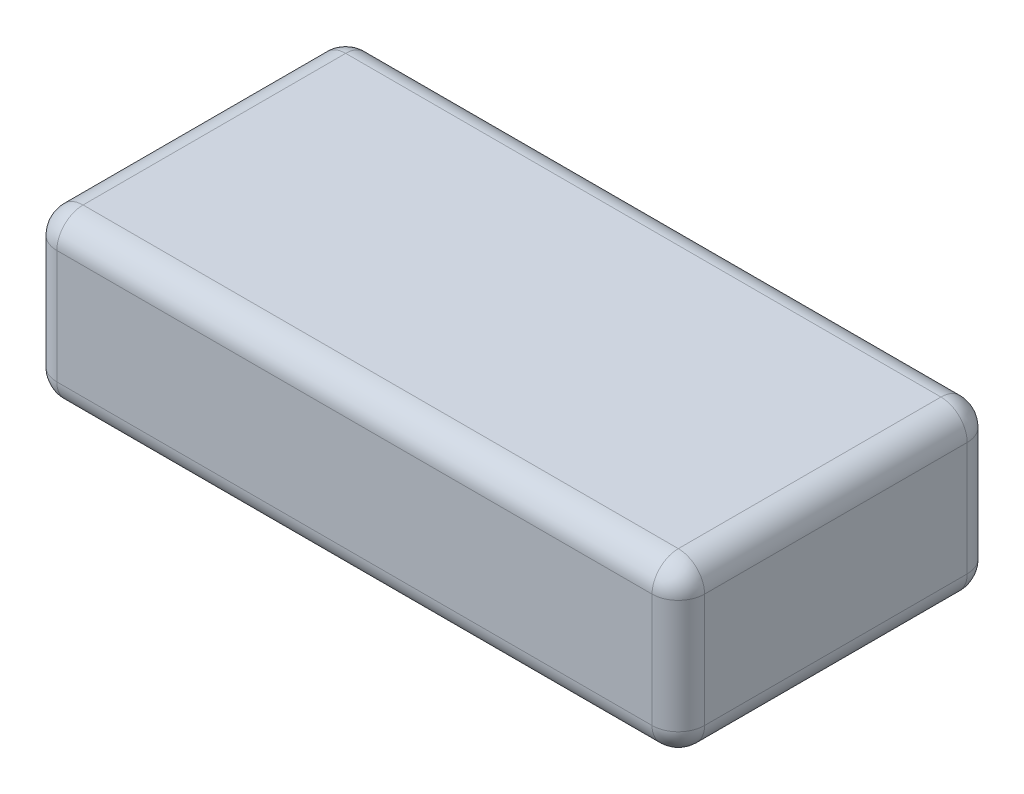
ISO-10303-21;
HEADER;
FILE_DESCRIPTION(('STEP AP214'),'2;1');
FILE_NAME('part.step','',(''),(''),'','','');
FILE_SCHEMA(('AUTOMOTIVE_DESIGN { 1 0 10303 214 1 1 1 1 }'));
ENDSEC;
DATA;
#1=APPLICATION_CONTEXT('core data for automotive mechanical design processes');
#2=APPLICATION_PROTOCOL_DEFINITION('international standard','automotive_design',2000,#1);
#3=PRODUCT_CONTEXT('',#1,'mechanical');
#4=PRODUCT('Part','Part','',(#3));
#5=PRODUCT_RELATED_PRODUCT_CATEGORY('part','',(#4));
#6=PRODUCT_DEFINITION_FORMATION('','',#4);
#7=PRODUCT_DEFINITION_CONTEXT('part definition',#1,'design');
#8=PRODUCT_DEFINITION('design','',#6,#7);
#9=PRODUCT_DEFINITION_SHAPE('','',#8);
#10=(LENGTH_UNIT() NAMED_UNIT(*) SI_UNIT(.MILLI.,.METRE.));
#11=(NAMED_UNIT(*) PLANE_ANGLE_UNIT() SI_UNIT($,.RADIAN.));
#12=(NAMED_UNIT(*) SI_UNIT($,.STERADIAN.) SOLID_ANGLE_UNIT());
#13=UNCERTAINTY_MEASURE_WITH_UNIT(LENGTH_MEASURE(1.E-05),#10,'distance_accuracy_value','');
#14=(GEOMETRIC_REPRESENTATION_CONTEXT(3) GLOBAL_UNCERTAINTY_ASSIGNED_CONTEXT((#13)) GLOBAL_UNIT_ASSIGNED_CONTEXT((#10,
#11,#12)) REPRESENTATION_CONTEXT('',''));
#15=CARTESIAN_POINT('',(0.,0.,0.));
#16=DIRECTION('',(0.,0.,1.));
#17=DIRECTION('',(1.,0.,0.));
#18=AXIS2_PLACEMENT_3D('',#15,#16,#17);
#19=CARTESIAN_POINT('',(37.,19.,18.));
#20=DIRECTION('',(-1.,0.,0.));
#21=DIRECTION('',(0.,0.,1.));
#22=AXIS2_PLACEMENT_3D('',#19,#20,#21);
#23=PLANE('',#22);
#24=DIRECTION('',(0.,0.,-1.));
#25=VECTOR('',#24,1.);
#26=CARTESIAN_POINT('',(37.,3.,-18.));
#27=LINE('',#26,#25);
#28=CARTESIAN_POINT('',(37.,3.,15.));
#29=VERTEX_POINT('',#28);
#30=CARTESIAN_POINT('',(37.,3.,-15.));
#31=VERTEX_POINT('',#30);
#32=EDGE_CURVE('E216',#29,#31,#27,.T.);
#33=ORIENTED_EDGE('',*,*,#32,.T.);
#34=DIRECTION('',(0.,-1.,0.));
#35=VECTOR('',#34,1.);
#36=CARTESIAN_POINT('',(37.,19.,-15.));
#37=LINE('',#36,#35);
#38=CARTESIAN_POINT('',(37.,16.,-15.));
#39=VERTEX_POINT('',#38);
#40=EDGE_CURVE('E220',#31,#39,#37,.F.);
#41=ORIENTED_EDGE('',*,*,#40,.T.);
#42=DIRECTION('',(0.,0.,-1.));
#43=VECTOR('',#42,1.);
#44=CARTESIAN_POINT('',(37.,16.,18.));
#45=LINE('',#44,#43);
#46=CARTESIAN_POINT('',(37.,16.,15.));
#47=VERTEX_POINT('',#46);
#48=EDGE_CURVE('E213',#39,#47,#45,.F.);
#49=ORIENTED_EDGE('',*,*,#48,.T.);
#50=DIRECTION('',(0.,-1.,0.));
#51=VECTOR('',#50,1.);
#52=CARTESIAN_POINT('',(37.,19.,15.));
#53=LINE('',#52,#51);
#54=EDGE_CURVE('E210',#47,#29,#53,.T.);
#55=ORIENTED_EDGE('',*,*,#54,.T.);
#56=EDGE_LOOP('',(#33,#41,#49,#55));
#57=FACE_BOUND('',#56,.T.);
#58=ADVANCED_FACE('F39',(#57),#23,.F.);
#59=CARTESIAN_POINT('',(-37.,19.,-18.));
#60=DIRECTION('',(0.,0.,1.));
#61=DIRECTION('',(1.,0.,0.));
#62=AXIS2_PLACEMENT_3D('',#59,#60,#61);
#63=PLANE('',#62);
#64=DIRECTION('',(-1.,0.,0.));
#65=VECTOR('',#64,1.);
#66=CARTESIAN_POINT('',(-37.,16.,-18.));
#67=LINE('',#66,#65);
#68=CARTESIAN_POINT('',(-34.,16.,-18.));
#69=VERTEX_POINT('',#68);
#70=CARTESIAN_POINT('',(34.,16.,-18.));
#71=VERTEX_POINT('',#70);
#72=EDGE_CURVE('E160',#69,#71,#67,.F.);
#73=ORIENTED_EDGE('',*,*,#72,.T.);
#74=DIRECTION('',(0.,-1.,0.));
#75=VECTOR('',#74,1.);
#76=CARTESIAN_POINT('',(34.,19.,-18.));
#77=LINE('',#76,#75);
#78=CARTESIAN_POINT('',(34.,3.,-18.));
#79=VERTEX_POINT('',#78);
#80=EDGE_CURVE('E164',#71,#79,#77,.T.);
#81=ORIENTED_EDGE('',*,*,#80,.T.);
#82=DIRECTION('',(-1.,0.,0.));
#83=VECTOR('',#82,1.);
#84=CARTESIAN_POINT('',(-37.,3.,-18.));
#85=LINE('',#84,#83);
#86=CARTESIAN_POINT('',(-34.,3.,-18.));
#87=VERTEX_POINT('',#86);
#88=EDGE_CURVE('E133',#79,#87,#85,.T.);
#89=ORIENTED_EDGE('',*,*,#88,.T.);
#90=DIRECTION('',(0.,-1.,0.));
#91=VECTOR('',#90,1.);
#92=CARTESIAN_POINT('',(-34.,19.,-18.));
#93=LINE('',#92,#91);
#94=EDGE_CURVE('E153',#87,#69,#93,.F.);
#95=ORIENTED_EDGE('',*,*,#94,.T.);
#96=EDGE_LOOP('',(#73,#81,#89,#95));
#97=FACE_BOUND('',#96,.T.);
#98=ADVANCED_FACE('F162',(#97),#63,.F.);
#99=CARTESIAN_POINT('',(-37.,19.,18.));
#100=DIRECTION('',(1.,0.,0.));
#101=DIRECTION('',(0.,0.,-1.));
#102=AXIS2_PLACEMENT_3D('',#99,#100,#101);
#103=PLANE('',#102);
#104=DIRECTION('',(0.,0.,1.));
#105=VECTOR('',#104,1.);
#106=CARTESIAN_POINT('',(-37.,16.,18.));
#107=LINE('',#106,#105);
#108=CARTESIAN_POINT('',(-37.,16.,15.));
#109=VERTEX_POINT('',#108);
#110=CARTESIAN_POINT('',(-37.,16.,-15.));
#111=VERTEX_POINT('',#110);
#112=EDGE_CURVE('E187',#109,#111,#107,.F.);
#113=ORIENTED_EDGE('',*,*,#112,.T.);
#114=DIRECTION('',(0.,-1.,0.));
#115=VECTOR('',#114,1.);
#116=CARTESIAN_POINT('',(-37.,19.,-15.));
#117=LINE('',#116,#115);
#118=CARTESIAN_POINT('',(-37.,3.,-15.));
#119=VERTEX_POINT('',#118);
#120=EDGE_CURVE('E194',#111,#119,#117,.T.);
#121=ORIENTED_EDGE('',*,*,#120,.T.);
#122=DIRECTION('',(0.,0.,1.));
#123=VECTOR('',#122,1.);
#124=CARTESIAN_POINT('',(-37.,3.,18.));
#125=LINE('',#124,#123);
#126=CARTESIAN_POINT('',(-37.,3.,15.));
#127=VERTEX_POINT('',#126);
#128=EDGE_CURVE('E190',#119,#127,#125,.T.);
#129=ORIENTED_EDGE('',*,*,#128,.T.);
#130=DIRECTION('',(0.,-1.,0.));
#131=VECTOR('',#130,1.);
#132=CARTESIAN_POINT('',(-37.,19.,15.));
#133=LINE('',#132,#131);
#134=EDGE_CURVE('E184',#127,#109,#133,.F.);
#135=ORIENTED_EDGE('',*,*,#134,.T.);
#136=EDGE_LOOP('',(#113,#121,#129,#135));
#137=FACE_BOUND('',#136,.T.);
#138=ADVANCED_FACE('F381',(#137),#103,.F.);
#139=CARTESIAN_POINT('',(-37.,19.,18.));
#140=DIRECTION('',(0.,0.,-1.));
#141=DIRECTION('',(-1.,0.,0.));
#142=AXIS2_PLACEMENT_3D('',#139,#140,#141);
#143=PLANE('',#142);
#144=DIRECTION('',(1.,0.,0.));
#145=VECTOR('',#144,1.);
#146=CARTESIAN_POINT('',(37.,3.,18.));
#147=LINE('',#146,#145);
#148=CARTESIAN_POINT('',(-34.,3.,18.));
#149=VERTEX_POINT('',#148);
#150=CARTESIAN_POINT('',(34.,3.,18.));
#151=VERTEX_POINT('',#150);
#152=EDGE_CURVE('E203',#149,#151,#147,.T.);
#153=ORIENTED_EDGE('',*,*,#152,.T.);
#154=DIRECTION('',(0.,-1.,0.));
#155=VECTOR('',#154,1.);
#156=CARTESIAN_POINT('',(34.,19.,18.));
#157=LINE('',#156,#155);
#158=CARTESIAN_POINT('',(34.,16.,18.));
#159=VERTEX_POINT('',#158);
#160=EDGE_CURVE('E207',#151,#159,#157,.F.);
#161=ORIENTED_EDGE('',*,*,#160,.T.);
#162=DIRECTION('',(1.,0.,0.));
#163=VECTOR('',#162,1.);
#164=CARTESIAN_POINT('',(-37.,16.,18.));
#165=LINE('',#164,#163);
#166=CARTESIAN_POINT('',(-34.,16.,18.));
#167=VERTEX_POINT('',#166);
#168=EDGE_CURVE('E200',#159,#167,#165,.F.);
#169=ORIENTED_EDGE('',*,*,#168,.T.);
#170=DIRECTION('',(0.,-1.,0.));
#171=VECTOR('',#170,1.);
#172=CARTESIAN_POINT('',(-34.,19.,18.));
#173=LINE('',#172,#171);
#174=EDGE_CURVE('E197',#167,#149,#173,.T.);
#175=ORIENTED_EDGE('',*,*,#174,.T.);
#176=EDGE_LOOP('',(#153,#161,#169,#175));
#177=FACE_BOUND('',#176,.T.);
#178=ADVANCED_FACE('F348',(#177),#143,.F.);
#179=CARTESIAN_POINT('',(0.,19.,0.));
#180=DIRECTION('',(0.,-1.,0.));
#181=DIRECTION('',(0.,0.,-1.));
#182=AXIS2_PLACEMENT_3D('',#179,#180,#181);
#183=PLANE('',#182);
#184=DIRECTION('',(0.,0.,1.));
#185=VECTOR('',#184,1.);
#186=CARTESIAN_POINT('',(-34.,19.,0.));
#187=LINE('',#186,#185);
#188=CARTESIAN_POINT('',(-34.,19.,-15.));
#189=VERTEX_POINT('',#188);
#190=CARTESIAN_POINT('',(-34.,19.,15.));
#191=VERTEX_POINT('',#190);
#192=EDGE_CURVE('E49',#189,#191,#187,.T.);
#193=ORIENTED_EDGE('',*,*,#192,.T.);
#194=DIRECTION('',(1.,0.,0.));
#195=VECTOR('',#194,1.);
#196=CARTESIAN_POINT('',(0.,19.,15.));
#197=LINE('',#196,#195);
#198=CARTESIAN_POINT('',(34.,19.,15.));
#199=VERTEX_POINT('',#198);
#200=EDGE_CURVE('E11',#191,#199,#197,.T.);
#201=ORIENTED_EDGE('',*,*,#200,.T.);
#202=DIRECTION('',(0.,0.,-1.));
#203=VECTOR('',#202,1.);
#204=CARTESIAN_POINT('',(34.,19.,0.));
#205=LINE('',#204,#203);
#206=CARTESIAN_POINT('',(34.,19.,-15.));
#207=VERTEX_POINT('',#206);
#208=EDGE_CURVE('E223',#199,#207,#205,.T.);
#209=ORIENTED_EDGE('',*,*,#208,.T.);
#210=DIRECTION('',(-1.,0.,0.));
#211=VECTOR('',#210,1.);
#212=CARTESIAN_POINT('',(0.,19.,-15.));
#213=LINE('',#212,#211);
#214=EDGE_CURVE('E60',#207,#189,#213,.T.);
#215=ORIENTED_EDGE('',*,*,#214,.T.);
#216=EDGE_LOOP('',(#193,#201,#209,#215));
#217=FACE_BOUND('',#216,.T.);
#218=ADVANCED_FACE('F328',(#217),#183,.F.);
#219=CARTESIAN_POINT('',(0.,0.,0.));
#220=DIRECTION('',(0.,-1.,0.));
#221=DIRECTION('',(0.,0.,-1.));
#222=AXIS2_PLACEMENT_3D('',#219,#220,#221);
#223=PLANE('',#222);
#224=DIRECTION('',(0.,0.,1.));
#225=VECTOR('',#224,1.);
#226=CARTESIAN_POINT('',(-34.,0.,-18.));
#227=LINE('',#226,#225);
#228=CARTESIAN_POINT('',(-34.,0.,15.));
#229=VERTEX_POINT('',#228);
#230=CARTESIAN_POINT('',(-34.,0.,-15.));
#231=VERTEX_POINT('',#230);
#232=EDGE_CURVE('E179',#229,#231,#227,.F.);
#233=ORIENTED_EDGE('',*,*,#232,.T.);
#234=DIRECTION('',(-1.,0.,0.));
#235=VECTOR('',#234,1.);
#236=CARTESIAN_POINT('',(37.,0.,-15.));
#237=LINE('',#236,#235);
#238=CARTESIAN_POINT('',(34.,0.,-15.));
#239=VERTEX_POINT('',#238);
#240=EDGE_CURVE('E135',#231,#239,#237,.F.);
#241=ORIENTED_EDGE('',*,*,#240,.T.);
#242=DIRECTION('',(0.,0.,-1.));
#243=VECTOR('',#242,1.);
#244=CARTESIAN_POINT('',(34.,0.,18.));
#245=LINE('',#244,#243);
#246=CARTESIAN_POINT('',(34.,0.,15.));
#247=VERTEX_POINT('',#246);
#248=EDGE_CURVE('E170',#239,#247,#245,.F.);
#249=ORIENTED_EDGE('',*,*,#248,.T.);
#250=DIRECTION('',(1.,0.,0.));
#251=VECTOR('',#250,1.);
#252=CARTESIAN_POINT('',(-37.,0.,15.));
#253=LINE('',#252,#251);
#254=EDGE_CURVE('E176',#247,#229,#253,.F.);
#255=ORIENTED_EDGE('',*,*,#254,.T.);
#256=EDGE_LOOP('',(#233,#241,#249,#255));
#257=FACE_BOUND('',#256,.T.);
#258=ADVANCED_FACE('F409',(#257),#223,.T.);
#259=CARTESIAN_POINT('',(0.,16.,15.));
#260=DIRECTION('',(1.,0.,0.));
#261=DIRECTION('',(0.,0.,-1.));
#262=AXIS2_PLACEMENT_3D('',#259,#260,#261);
#263=CYLINDRICAL_SURFACE('',#262,3.);
#264=CARTESIAN_POINT('',(34.,16.,15.));
#265=DIRECTION('',(1.,0.,0.));
#266=DIRECTION('',(0.,0.,-1.));
#267=AXIS2_PLACEMENT_3D('',#264,#265,#266);
#268=CIRCLE('',#267,3.);
#269=EDGE_CURVE('E43',#199,#159,#268,.T.);
#270=ORIENTED_EDGE('',*,*,#269,.F.);
#271=ORIENTED_EDGE('',*,*,#200,.F.);
#272=CARTESIAN_POINT('',(-34.,16.,15.));
#273=DIRECTION('',(-1.,0.,0.));
#274=DIRECTION('',(0.,0.,1.));
#275=AXIS2_PLACEMENT_3D('',#272,#273,#274);
#276=CIRCLE('',#275,3.);
#277=EDGE_CURVE('E299',#167,#191,#276,.T.);
#278=ORIENTED_EDGE('',*,*,#277,.F.);
#279=ORIENTED_EDGE('',*,*,#168,.F.);
#280=EDGE_LOOP('',(#270,#271,#278,#279));
#281=FACE_BOUND('',#280,.T.);
#282=ADVANCED_FACE('F41',(#281),#263,.T.);
#283=CARTESIAN_POINT('',(34.,16.,15.));
#284=DIRECTION('',(0.,0.,1.));
#285=DIRECTION('',(1.,0.,0.));
#286=AXIS2_PLACEMENT_3D('',#283,#284,#285);
#287=SPHERICAL_SURFACE('',#286,3.);
#288=CARTESIAN_POINT('',(34.,16.,15.));
#289=DIRECTION('',(0.,0.,1.));
#290=DIRECTION('',(1.,0.,0.));
#291=AXIS2_PLACEMENT_3D('',#288,#289,#290);
#292=CIRCLE('',#291,3.);
#293=EDGE_CURVE('E292',#199,#47,#292,.F.);
#294=ORIENTED_EDGE('',*,*,#293,.F.);
#295=ORIENTED_EDGE('',*,*,#269,.T.);
#296=CARTESIAN_POINT('',(34.,16.,15.));
#297=DIRECTION('',(0.,1.,0.));
#298=DIRECTION('',(0.,0.,1.));
#299=AXIS2_PLACEMENT_3D('',#296,#297,#298);
#300=CIRCLE('',#299,3.);
#301=EDGE_CURVE('E296',#47,#159,#300,.F.);
#302=ORIENTED_EDGE('',*,*,#301,.F.);
#303=EDGE_LOOP('',(#294,#295,#302));
#304=FACE_BOUND('',#303,.T.);
#305=ADVANCED_FACE('F312',(#304),#287,.T.);
#306=CARTESIAN_POINT('',(-34.,16.,15.));
#307=DIRECTION('',(0.,1.,0.));
#308=DIRECTION('',(0.,0.,1.));
#309=AXIS2_PLACEMENT_3D('',#306,#307,#308);
#310=SPHERICAL_SURFACE('',#309,3.);
#311=CARTESIAN_POINT('',(-34.,16.,15.));
#312=DIRECTION('',(0.,1.,0.));
#313=DIRECTION('',(0.,0.,1.));
#314=AXIS2_PLACEMENT_3D('',#311,#312,#313);
#315=CIRCLE('',#314,3.);
#316=EDGE_CURVE('E284',#167,#109,#315,.F.);
#317=ORIENTED_EDGE('',*,*,#316,.F.);
#318=ORIENTED_EDGE('',*,*,#277,.T.);
#319=CARTESIAN_POINT('',(-34.,16.,15.));
#320=DIRECTION('',(0.,0.,1.));
#321=DIRECTION('',(1.,0.,0.));
#322=AXIS2_PLACEMENT_3D('',#319,#320,#321);
#323=CIRCLE('',#322,3.);
#324=EDGE_CURVE('E288',#109,#191,#323,.F.);
#325=ORIENTED_EDGE('',*,*,#324,.F.);
#326=EDGE_LOOP('',(#317,#318,#325));
#327=FACE_BOUND('',#326,.T.);
#328=ADVANCED_FACE('F340',(#327),#310,.T.);
#329=CARTESIAN_POINT('',(34.,19.,15.));
#330=DIRECTION('',(0.,-1.,0.));
#331=DIRECTION('',(0.,0.,-1.));
#332=AXIS2_PLACEMENT_3D('',#329,#330,#331);
#333=CYLINDRICAL_SURFACE('',#332,3.);
#334=ORIENTED_EDGE('',*,*,#301,.T.);
#335=ORIENTED_EDGE('',*,*,#160,.F.);
#336=CARTESIAN_POINT('',(34.,3.,15.));
#337=DIRECTION('',(0.,-1.,0.));
#338=DIRECTION('',(0.,0.,-1.));
#339=AXIS2_PLACEMENT_3D('',#336,#337,#338);
#340=CIRCLE('',#339,3.);
#341=EDGE_CURVE('E277',#29,#151,#340,.T.);
#342=ORIENTED_EDGE('',*,*,#341,.F.);
#343=ORIENTED_EDGE('',*,*,#54,.F.);
#344=EDGE_LOOP('',(#334,#335,#342,#343));
#345=FACE_BOUND('',#344,.T.);
#346=ADVANCED_FACE('F318',(#345),#333,.T.);
#347=CARTESIAN_POINT('',(34.,16.,0.));
#348=DIRECTION('',(0.,0.,-1.));
#349=DIRECTION('',(-1.,0.,0.));
#350=AXIS2_PLACEMENT_3D('',#347,#348,#349);
#351=CYLINDRICAL_SURFACE('',#350,3.);
#352=ORIENTED_EDGE('',*,*,#293,.T.);
#353=ORIENTED_EDGE('',*,*,#48,.F.);
#354=CARTESIAN_POINT('',(34.,16.,-15.));
#355=DIRECTION('',(0.,0.,-1.));
#356=DIRECTION('',(-1.,0.,0.));
#357=AXIS2_PLACEMENT_3D('',#354,#355,#356);
#358=CIRCLE('',#357,3.);
#359=EDGE_CURVE('E273',#207,#39,#358,.T.);
#360=ORIENTED_EDGE('',*,*,#359,.F.);
#361=ORIENTED_EDGE('',*,*,#208,.F.);
#362=EDGE_LOOP('',(#352,#353,#360,#361));
#363=FACE_BOUND('',#362,.T.);
#364=ADVANCED_FACE('F327',(#363),#351,.T.);
#365=CARTESIAN_POINT('',(0.,16.,-15.));
#366=DIRECTION('',(-1.,0.,0.));
#367=DIRECTION('',(0.,0.,1.));
#368=AXIS2_PLACEMENT_3D('',#365,#366,#367);
#369=CYLINDRICAL_SURFACE('',#368,3.);
#370=CARTESIAN_POINT('',(-34.,16.,-15.));
#371=DIRECTION('',(-1.,0.,0.));
#372=DIRECTION('',(0.,0.,1.));
#373=AXIS2_PLACEMENT_3D('',#370,#371,#372);
#374=CIRCLE('',#373,3.);
#375=EDGE_CURVE('E265',#189,#69,#374,.T.);
#376=ORIENTED_EDGE('',*,*,#375,.F.);
#377=ORIENTED_EDGE('',*,*,#214,.F.);
#378=CARTESIAN_POINT('',(34.,16.,-15.));
#379=DIRECTION('',(1.,0.,0.));
#380=DIRECTION('',(0.,0.,-1.));
#381=AXIS2_PLACEMENT_3D('',#378,#379,#380);
#382=CIRCLE('',#381,3.);
#383=EDGE_CURVE('E269',#71,#207,#382,.T.);
#384=ORIENTED_EDGE('',*,*,#383,.F.);
#385=ORIENTED_EDGE('',*,*,#72,.F.);
#386=EDGE_LOOP('',(#376,#377,#384,#385));
#387=FACE_BOUND('',#386,.T.);
#388=ADVANCED_FACE('F332',(#387),#369,.T.);
#389=CARTESIAN_POINT('',(-34.,16.,0.));
#390=DIRECTION('',(0.,0.,1.));
#391=DIRECTION('',(1.,0.,0.));
#392=AXIS2_PLACEMENT_3D('',#389,#390,#391);
#393=CYLINDRICAL_SURFACE('',#392,3.);
#394=ORIENTED_EDGE('',*,*,#324,.T.);
#395=ORIENTED_EDGE('',*,*,#192,.F.);
#396=CARTESIAN_POINT('',(-34.,16.,-15.));
#397=DIRECTION('',(0.,0.,-1.));
#398=DIRECTION('',(0.,1.,0.));
#399=AXIS2_PLACEMENT_3D('',#396,#397,#398);
#400=CIRCLE('',#399,3.);
#401=EDGE_CURVE('E261',#111,#189,#400,.T.);
#402=ORIENTED_EDGE('',*,*,#401,.F.);
#403=ORIENTED_EDGE('',*,*,#112,.F.);
#404=EDGE_LOOP('',(#394,#395,#402,#403));
#405=FACE_BOUND('',#404,.T.);
#406=ADVANCED_FACE('F339',(#405),#393,.T.);
#407=CARTESIAN_POINT('',(-34.,19.,15.));
#408=DIRECTION('',(0.,-1.,0.));
#409=DIRECTION('',(0.,0.,-1.));
#410=AXIS2_PLACEMENT_3D('',#407,#408,#409);
#411=CYLINDRICAL_SURFACE('',#410,3.);
#412=ORIENTED_EDGE('',*,*,#316,.T.);
#413=ORIENTED_EDGE('',*,*,#134,.F.);
#414=CARTESIAN_POINT('',(-34.,3.,15.));
#415=DIRECTION('',(0.,-1.,0.));
#416=DIRECTION('',(0.,0.,-1.));
#417=AXIS2_PLACEMENT_3D('',#414,#415,#416);
#418=CIRCLE('',#417,3.);
#419=EDGE_CURVE('E257',#149,#127,#418,.T.);
#420=ORIENTED_EDGE('',*,*,#419,.F.);
#421=ORIENTED_EDGE('',*,*,#174,.F.);
#422=EDGE_LOOP('',(#412,#413,#420,#421));
#423=FACE_BOUND('',#422,.T.);
#424=ADVANCED_FACE('F345',(#423),#411,.T.);
#425=CARTESIAN_POINT('',(-37.,3.,15.));
#426=DIRECTION('',(-1.,0.,0.));
#427=DIRECTION('',(0.,0.,1.));
#428=AXIS2_PLACEMENT_3D('',#425,#426,#427);
#429=CYLINDRICAL_SURFACE('',#428,3.);
#430=CARTESIAN_POINT('',(34.,3.,15.));
#431=DIRECTION('',(1.,0.,0.));
#432=DIRECTION('',(0.,0.,-1.));
#433=AXIS2_PLACEMENT_3D('',#430,#431,#432);
#434=CIRCLE('',#433,3.);
#435=EDGE_CURVE('E280',#151,#247,#434,.T.);
#436=ORIENTED_EDGE('',*,*,#435,.F.);
#437=ORIENTED_EDGE('',*,*,#152,.F.);
#438=CARTESIAN_POINT('',(-34.,3.,15.));
#439=DIRECTION('',(-1.,0.,0.));
#440=DIRECTION('',(0.,0.,1.));
#441=AXIS2_PLACEMENT_3D('',#438,#439,#440);
#442=CIRCLE('',#441,3.);
#443=EDGE_CURVE('E253',#229,#149,#442,.T.);
#444=ORIENTED_EDGE('',*,*,#443,.F.);
#445=ORIENTED_EDGE('',*,*,#254,.F.);
#446=EDGE_LOOP('',(#436,#437,#444,#445));
#447=FACE_BOUND('',#446,.T.);
#448=ADVANCED_FACE('F352',(#447),#429,.T.);
#449=CARTESIAN_POINT('',(34.,3.,15.));
#450=DIRECTION('',(0.,0.,1.));
#451=DIRECTION('',(0.,-1.,0.));
#452=AXIS2_PLACEMENT_3D('',#449,#450,#451);
#453=SPHERICAL_SURFACE('',#452,3.);
#454=ORIENTED_EDGE('',*,*,#341,.T.);
#455=ORIENTED_EDGE('',*,*,#435,.T.);
#456=CARTESIAN_POINT('',(34.,3.,15.));
#457=DIRECTION('',(0.,0.,1.));
#458=DIRECTION('',(1.,0.,0.));
#459=AXIS2_PLACEMENT_3D('',#456,#457,#458);
#460=CIRCLE('',#459,3.);
#461=EDGE_CURVE('E249',#29,#247,#460,.F.);
#462=ORIENTED_EDGE('',*,*,#461,.F.);
#463=EDGE_LOOP('',(#454,#455,#462));
#464=FACE_BOUND('',#463,.T.);
#465=ADVANCED_FACE('F356',(#464),#453,.T.);
#466=CARTESIAN_POINT('',(34.,16.,-15.));
#467=DIRECTION('',(0.,1.,0.));
#468=DIRECTION('',(0.,0.,1.));
#469=AXIS2_PLACEMENT_3D('',#466,#467,#468);
#470=SPHERICAL_SURFACE('',#469,3.);
#471=ORIENTED_EDGE('',*,*,#383,.T.);
#472=ORIENTED_EDGE('',*,*,#359,.T.);
#473=CARTESIAN_POINT('',(34.,16.,-15.));
#474=DIRECTION('',(0.,1.,0.));
#475=DIRECTION('',(0.,0.,1.));
#476=AXIS2_PLACEMENT_3D('',#473,#474,#475);
#477=CIRCLE('',#476,3.);
#478=EDGE_CURVE('E245',#71,#39,#477,.F.);
#479=ORIENTED_EDGE('',*,*,#478,.F.);
#480=EDGE_LOOP('',(#471,#472,#479));
#481=FACE_BOUND('',#480,.T.);
#482=ADVANCED_FACE('F366',(#481),#470,.T.);
#483=CARTESIAN_POINT('',(-34.,16.,-15.));
#484=DIRECTION('',(0.,1.,0.));
#485=DIRECTION('',(0.,0.,1.));
#486=AXIS2_PLACEMENT_3D('',#483,#484,#485);
#487=SPHERICAL_SURFACE('',#486,3.);
#488=ORIENTED_EDGE('',*,*,#401,.T.);
#489=ORIENTED_EDGE('',*,*,#375,.T.);
#490=CARTESIAN_POINT('',(-34.,16.,-15.));
#491=DIRECTION('',(0.,1.,0.));
#492=DIRECTION('',(0.,0.,1.));
#493=AXIS2_PLACEMENT_3D('',#490,#491,#492);
#494=CIRCLE('',#493,3.);
#495=EDGE_CURVE('E156',#111,#69,#494,.F.);
#496=ORIENTED_EDGE('',*,*,#495,.F.);
#497=EDGE_LOOP('',(#488,#489,#496));
#498=FACE_BOUND('',#497,.T.);
#499=ADVANCED_FACE('F336',(#498),#487,.T.);
#500=CARTESIAN_POINT('',(-34.,3.,15.));
#501=DIRECTION('',(0.,0.,1.));
#502=DIRECTION('',(0.,-1.,0.));
#503=AXIS2_PLACEMENT_3D('',#500,#501,#502);
#504=SPHERICAL_SURFACE('',#503,3.);
#505=ORIENTED_EDGE('',*,*,#443,.T.);
#506=ORIENTED_EDGE('',*,*,#419,.T.);
#507=CARTESIAN_POINT('',(-34.,3.,15.));
#508=DIRECTION('',(0.,0.,1.));
#509=DIRECTION('',(1.,0.,0.));
#510=AXIS2_PLACEMENT_3D('',#507,#508,#509);
#511=CIRCLE('',#510,3.);
#512=EDGE_CURVE('E240',#229,#127,#511,.F.);
#513=ORIENTED_EDGE('',*,*,#512,.F.);
#514=EDGE_LOOP('',(#505,#506,#513));
#515=FACE_BOUND('',#514,.T.);
#516=ADVANCED_FACE('F373',(#515),#504,.T.);
#517=CARTESIAN_POINT('',(34.,3.,18.));
#518=DIRECTION('',(0.,0.,1.));
#519=DIRECTION('',(1.,0.,0.));
#520=AXIS2_PLACEMENT_3D('',#517,#518,#519);
#521=CYLINDRICAL_SURFACE('',#520,3.);
#522=ORIENTED_EDGE('',*,*,#461,.T.);
#523=ORIENTED_EDGE('',*,*,#248,.F.);
#524=CARTESIAN_POINT('',(34.,3.,-15.));
#525=DIRECTION('',(0.,0.,-1.));
#526=DIRECTION('',(-1.,0.,0.));
#527=AXIS2_PLACEMENT_3D('',#524,#525,#526);
#528=CIRCLE('',#527,3.);
#529=EDGE_CURVE('E236',#31,#239,#528,.T.);
#530=ORIENTED_EDGE('',*,*,#529,.F.);
#531=ORIENTED_EDGE('',*,*,#32,.F.);
#532=EDGE_LOOP('',(#522,#523,#530,#531));
#533=FACE_BOUND('',#532,.T.);
#534=ADVANCED_FACE('F359',(#533),#521,.T.);
#535=CARTESIAN_POINT('',(34.,19.,-15.));
#536=DIRECTION('',(0.,-1.,0.));
#537=DIRECTION('',(0.,0.,-1.));
#538=AXIS2_PLACEMENT_3D('',#535,#536,#537);
#539=CYLINDRICAL_SURFACE('',#538,3.);
#540=ORIENTED_EDGE('',*,*,#478,.T.);
#541=ORIENTED_EDGE('',*,*,#40,.F.);
#542=CARTESIAN_POINT('',(34.,3.,-15.));
#543=DIRECTION('',(0.,-1.,0.));
#544=DIRECTION('',(0.,0.,-1.));
#545=AXIS2_PLACEMENT_3D('',#542,#543,#544);
#546=CIRCLE('',#545,3.);
#547=EDGE_CURVE('E150',#79,#31,#546,.T.);
#548=ORIENTED_EDGE('',*,*,#547,.F.);
#549=ORIENTED_EDGE('',*,*,#80,.F.);
#550=EDGE_LOOP('',(#540,#541,#548,#549));
#551=FACE_BOUND('',#550,.T.);
#552=ADVANCED_FACE('F364',(#551),#539,.T.);
#553=CARTESIAN_POINT('',(-34.,19.,-15.));
#554=DIRECTION('',(0.,-1.,0.));
#555=DIRECTION('',(0.,0.,-1.));
#556=AXIS2_PLACEMENT_3D('',#553,#554,#555);
#557=CYLINDRICAL_SURFACE('',#556,3.);
#558=ORIENTED_EDGE('',*,*,#495,.T.);
#559=ORIENTED_EDGE('',*,*,#94,.F.);
#560=CARTESIAN_POINT('',(-34.,3.,-15.));
#561=DIRECTION('',(0.,-1.,0.));
#562=DIRECTION('',(0.,0.,-1.));
#563=AXIS2_PLACEMENT_3D('',#560,#561,#562);
#564=CIRCLE('',#563,3.);
#565=EDGE_CURVE('E142',#119,#87,#564,.T.);
#566=ORIENTED_EDGE('',*,*,#565,.F.);
#567=ORIENTED_EDGE('',*,*,#120,.F.);
#568=EDGE_LOOP('',(#558,#559,#566,#567));
#569=FACE_BOUND('',#568,.T.);
#570=ADVANCED_FACE('F154',(#569),#557,.T.);
#571=CARTESIAN_POINT('',(-34.,3.,18.));
#572=DIRECTION('',(0.,0.,-1.));
#573=DIRECTION('',(-1.,0.,0.));
#574=AXIS2_PLACEMENT_3D('',#571,#572,#573);
#575=CYLINDRICAL_SURFACE('',#574,3.);
#576=ORIENTED_EDGE('',*,*,#512,.T.);
#577=ORIENTED_EDGE('',*,*,#128,.F.);
#578=CARTESIAN_POINT('',(-34.,3.,-15.));
#579=DIRECTION('',(0.,0.,-1.));
#580=DIRECTION('',(-1.,0.,0.));
#581=AXIS2_PLACEMENT_3D('',#578,#579,#580);
#582=CIRCLE('',#581,3.);
#583=EDGE_CURVE('E146',#231,#119,#582,.T.);
#584=ORIENTED_EDGE('',*,*,#583,.F.);
#585=ORIENTED_EDGE('',*,*,#232,.F.);
#586=EDGE_LOOP('',(#576,#577,#584,#585));
#587=FACE_BOUND('',#586,.T.);
#588=ADVANCED_FACE('F392',(#587),#575,.T.);
#589=CARTESIAN_POINT('',(34.,3.,-15.));
#590=DIRECTION('',(1.,0.,0.));
#591=DIRECTION('',(0.,1.,0.));
#592=AXIS2_PLACEMENT_3D('',#589,#590,#591);
#593=SPHERICAL_SURFACE('',#592,3.);
#594=ORIENTED_EDGE('',*,*,#547,.T.);
#595=ORIENTED_EDGE('',*,*,#529,.T.);
#596=CARTESIAN_POINT('',(34.,3.,-15.));
#597=DIRECTION('',(1.,0.,0.));
#598=DIRECTION('',(0.,0.,-1.));
#599=AXIS2_PLACEMENT_3D('',#596,#597,#598);
#600=CIRCLE('',#599,3.);
#601=EDGE_CURVE('E139',#79,#239,#600,.F.);
#602=ORIENTED_EDGE('',*,*,#601,.F.);
#603=EDGE_LOOP('',(#594,#595,#602));
#604=FACE_BOUND('',#603,.T.);
#605=ADVANCED_FACE('F389',(#604),#593,.T.);
#606=CARTESIAN_POINT('',(-34.,3.,-15.));
#607=DIRECTION('',(-1.,0.,0.));
#608=DIRECTION('',(0.,0.,1.));
#609=AXIS2_PLACEMENT_3D('',#606,#607,#608);
#610=SPHERICAL_SURFACE('',#609,3.);
#611=ORIENTED_EDGE('',*,*,#583,.T.);
#612=ORIENTED_EDGE('',*,*,#565,.T.);
#613=CARTESIAN_POINT('',(-34.,3.,-15.));
#614=DIRECTION('',(-1.,0.,0.));
#615=DIRECTION('',(0.,0.,1.));
#616=AXIS2_PLACEMENT_3D('',#613,#614,#615);
#617=CIRCLE('',#616,3.);
#618=EDGE_CURVE('E129',#231,#87,#617,.F.);
#619=ORIENTED_EDGE('',*,*,#618,.F.);
#620=EDGE_LOOP('',(#611,#612,#619));
#621=FACE_BOUND('',#620,.T.);
#622=ADVANCED_FACE('F144',(#621),#610,.T.);
#623=CARTESIAN_POINT('',(-37.,3.,-15.));
#624=DIRECTION('',(1.,0.,0.));
#625=DIRECTION('',(0.,0.,-1.));
#626=AXIS2_PLACEMENT_3D('',#623,#624,#625);
#627=CYLINDRICAL_SURFACE('',#626,3.);
#628=ORIENTED_EDGE('',*,*,#601,.T.);
#629=ORIENTED_EDGE('',*,*,#240,.F.);
#630=ORIENTED_EDGE('',*,*,#618,.T.);
#631=ORIENTED_EDGE('',*,*,#88,.F.);
#632=EDGE_LOOP('',(#628,#629,#630,#631));
#633=FACE_BOUND('',#632,.T.);
#634=ADVANCED_FACE('F131',(#633),#627,.T.);
#635=CLOSED_SHELL('',(#58,#98,#138,#178,#218,#258,#282,#305,#328,#346,#364,#388,#406,#424,#448,
#465,#482,#499,#516,#534,#552,#570,#588,#605,#622,#634));
#636=MANIFOLD_SOLID_BREP('B2',#635);
#637=ADVANCED_BREP_SHAPE_REPRESENTATION('',(#18,#636),#14);
#638=SHAPE_DEFINITION_REPRESENTATION(#9,#637);
ENDSEC;
END-ISO-10303-21;
